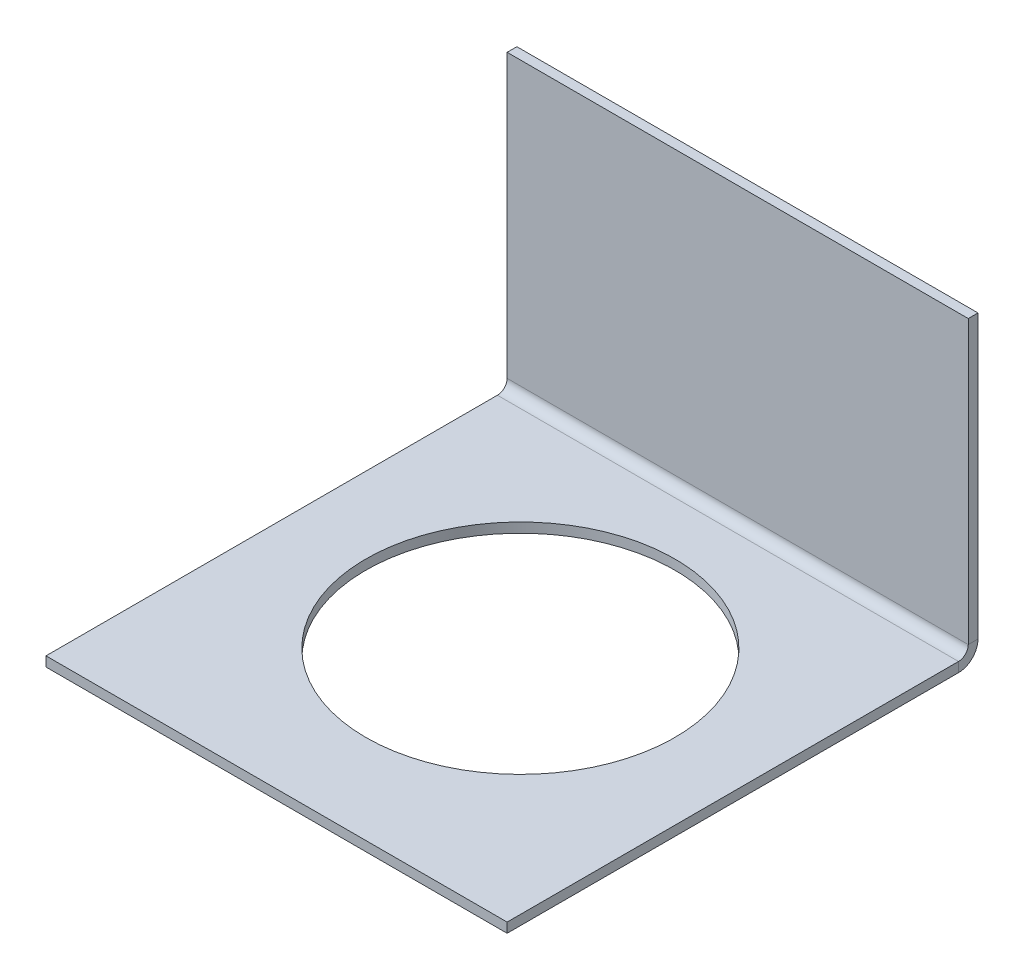
ISO-10303-21;
HEADER;
FILE_DESCRIPTION(('STEP AP214'),'2;1');
FILE_NAME('part.step','',(''),(''),'','','');
FILE_SCHEMA(('AUTOMOTIVE_DESIGN { 1 0 10303 214 1 1 1 1 }'));
ENDSEC;
DATA;
#1=APPLICATION_CONTEXT('core data for automotive mechanical design processes');
#2=APPLICATION_PROTOCOL_DEFINITION('international standard','automotive_design',2000,#1);
#3=PRODUCT_CONTEXT('',#1,'mechanical');
#4=PRODUCT('Part','Part','',(#3));
#5=PRODUCT_RELATED_PRODUCT_CATEGORY('part','',(#4));
#6=PRODUCT_DEFINITION_FORMATION('','',#4);
#7=PRODUCT_DEFINITION_CONTEXT('part definition',#1,'design');
#8=PRODUCT_DEFINITION('design','',#6,#7);
#9=PRODUCT_DEFINITION_SHAPE('','',#8);
#10=(LENGTH_UNIT() NAMED_UNIT(*) SI_UNIT(.MILLI.,.METRE.));
#11=(NAMED_UNIT(*) PLANE_ANGLE_UNIT() SI_UNIT($,.RADIAN.));
#12=(NAMED_UNIT(*) SI_UNIT($,.STERADIAN.) SOLID_ANGLE_UNIT());
#13=UNCERTAINTY_MEASURE_WITH_UNIT(LENGTH_MEASURE(1.E-05),#10,'distance_accuracy_value','');
#14=(GEOMETRIC_REPRESENTATION_CONTEXT(3) GLOBAL_UNCERTAINTY_ASSIGNED_CONTEXT((#13)) GLOBAL_UNIT_ASSIGNED_CONTEXT((#10,
#11,#12)) REPRESENTATION_CONTEXT('',''));
#15=CARTESIAN_POINT('',(0.,0.,0.));
#16=DIRECTION('',(0.,0.,1.));
#17=DIRECTION('',(1.,0.,0.));
#18=AXIS2_PLACEMENT_3D('',#15,#16,#17);
#19=CARTESIAN_POINT('',(0.,-1.,0.));
#20=DIRECTION('',(-1.,0.,0.));
#21=DIRECTION('',(0.,0.,1.));
#22=AXIS2_PLACEMENT_3D('',#19,#20,#21);
#23=PLANE('',#22);
#24=DIRECTION('',(0.,0.,1.));
#25=VECTOR('',#24,1.);
#26=CARTESIAN_POINT('',(0.,0.,0.));
#27=LINE('',#26,#25);
#28=CARTESIAN_POINT('',(0.,0.,0.999999999999997));
#29=VERTEX_POINT('',#28);
#30=CARTESIAN_POINT('',(0.,0.,47.36));
#31=VERTEX_POINT('',#30);
#32=EDGE_CURVE('E89',#29,#31,#27,.T.);
#33=ORIENTED_EDGE('',*,*,#32,.F.);
#34=DIRECTION('',(0.,-1.,0.));
#35=VECTOR('',#34,1.);
#36=CARTESIAN_POINT('',(0.,0.,0.999999999999997));
#37=LINE('',#36,#35);
#38=CARTESIAN_POINT('',(0.,-1.00000000000001,0.999999999999997));
#39=VERTEX_POINT('',#38);
#40=EDGE_CURVE('E98',#29,#39,#37,.T.);
#41=ORIENTED_EDGE('',*,*,#40,.T.);
#42=DIRECTION('',(0.,0.,1.));
#43=VECTOR('',#42,1.);
#44=CARTESIAN_POINT('',(0.,-1.,0.));
#45=LINE('',#44,#43);
#46=CARTESIAN_POINT('',(0.,-1.,47.36));
#47=VERTEX_POINT('',#46);
#48=EDGE_CURVE('E86',#39,#47,#45,.T.);
#49=ORIENTED_EDGE('',*,*,#48,.T.);
#50=DIRECTION('',(0.,1.,0.));
#51=VECTOR('',#50,1.);
#52=CARTESIAN_POINT('',(0.,-1.,47.36));
#53=LINE('',#52,#51);
#54=EDGE_CURVE('E44',#47,#31,#53,.T.);
#55=ORIENTED_EDGE('',*,*,#54,.T.);
#56=EDGE_LOOP('',(#33,#41,#49,#55));
#57=FACE_BOUND('',#56,.T.);
#58=ADVANCED_FACE('F41',(#57),#23,.T.);
#59=CARTESIAN_POINT('',(0.,-1.,0.));
#60=DIRECTION('',(0.,1.,0.));
#61=DIRECTION('',(0.,0.,1.));
#62=AXIS2_PLACEMENT_3D('',#59,#60,#61);
#63=PLANE('',#62);
#64=CARTESIAN_POINT('',(23.68,-1.00000000000001,22.32));
#65=DIRECTION('',(0.,1.,0.));
#66=DIRECTION('',(0.,0.,1.));
#67=AXIS2_PLACEMENT_3D('',#64,#65,#66);
#68=CIRCLE('',#67,15.875);
#69=CARTESIAN_POINT('',(23.68,-1.00000000000001,38.195));
#70=VERTEX_POINT('',#69);
#71=EDGE_CURVE('E150',#70,#70,#68,.T.);
#72=ORIENTED_EDGE('',*,*,#71,.T.);
#73=EDGE_LOOP('',(#72));
#74=FACE_BOUND('',#73,.T.);
#75=DIRECTION('',(-1.,0.,0.));
#76=VECTOR('',#75,1.);
#77=CARTESIAN_POINT('',(0.,-1.00000000000001,0.999999999999997));
#78=LINE('',#77,#76);
#79=CARTESIAN_POINT('',(47.36,-1.,0.999999999999997));
#80=VERTEX_POINT('',#79);
#81=EDGE_CURVE('E114',#39,#80,#78,.F.);
#82=ORIENTED_EDGE('',*,*,#81,.T.);
#83=DIRECTION('',(0.,0.,-1.));
#84=VECTOR('',#83,1.);
#85=CARTESIAN_POINT('',(47.36,-1.,0.));
#86=LINE('',#85,#84);
#87=CARTESIAN_POINT('',(47.36,-1.,47.36));
#88=VERTEX_POINT('',#87);
#89=EDGE_CURVE('E94',#88,#80,#86,.T.);
#90=ORIENTED_EDGE('',*,*,#89,.F.);
#91=DIRECTION('',(1.,0.,0.));
#92=VECTOR('',#91,1.);
#93=CARTESIAN_POINT('',(0.,-1.,47.36));
#94=LINE('',#93,#92);
#95=EDGE_CURVE('E79',#47,#88,#94,.T.);
#96=ORIENTED_EDGE('',*,*,#95,.F.);
#97=ORIENTED_EDGE('',*,*,#48,.F.);
#98=EDGE_LOOP('',(#82,#90,#96,#97));
#99=FACE_BOUND('',#98,.T.);
#100=ADVANCED_FACE('F161',(#74,#99),#63,.F.);
#101=CARTESIAN_POINT('',(0.,0.,0.));
#102=DIRECTION('',(0.,1.,0.));
#103=DIRECTION('',(0.,0.,1.));
#104=AXIS2_PLACEMENT_3D('',#101,#102,#103);
#105=PLANE('',#104);
#106=CARTESIAN_POINT('',(23.68,0.,22.32));
#107=DIRECTION('',(0.,1.,0.));
#108=DIRECTION('',(0.,0.,1.));
#109=AXIS2_PLACEMENT_3D('',#106,#107,#108);
#110=CIRCLE('',#109,15.875);
#111=CARTESIAN_POINT('',(23.68,0.,38.195));
#112=VERTEX_POINT('',#111);
#113=EDGE_CURVE('E155',#112,#112,#110,.T.);
#114=ORIENTED_EDGE('',*,*,#113,.F.);
#115=EDGE_LOOP('',(#114));
#116=FACE_BOUND('',#115,.T.);
#117=DIRECTION('',(0.,0.,-1.));
#118=VECTOR('',#117,1.);
#119=CARTESIAN_POINT('',(47.36,0.,0.));
#120=LINE('',#119,#118);
#121=CARTESIAN_POINT('',(47.36,0.,47.36));
#122=VERTEX_POINT('',#121);
#123=CARTESIAN_POINT('',(47.36,0.,0.999999999999997));
#124=VERTEX_POINT('',#123);
#125=EDGE_CURVE('E81',#122,#124,#120,.T.);
#126=ORIENTED_EDGE('',*,*,#125,.T.);
#127=DIRECTION('',(-1.,0.,0.));
#128=VECTOR('',#127,1.);
#129=CARTESIAN_POINT('',(0.,0.,0.999999999999997));
#130=LINE('',#129,#128);
#131=EDGE_CURVE('E55',#29,#124,#130,.F.);
#132=ORIENTED_EDGE('',*,*,#131,.F.);
#133=ORIENTED_EDGE('',*,*,#32,.T.);
#134=DIRECTION('',(1.,0.,0.));
#135=VECTOR('',#134,1.);
#136=CARTESIAN_POINT('',(0.,0.,47.36));
#137=LINE('',#136,#135);
#138=EDGE_CURVE('E77',#31,#122,#137,.T.);
#139=ORIENTED_EDGE('',*,*,#138,.T.);
#140=EDGE_LOOP('',(#126,#132,#133,#139));
#141=FACE_BOUND('',#140,.T.);
#142=ADVANCED_FACE('F88',(#116,#141),#105,.T.);
#143=CARTESIAN_POINT('',(47.36,-1.,0.));
#144=DIRECTION('',(1.,0.,0.));
#145=DIRECTION('',(0.,0.,-1.));
#146=AXIS2_PLACEMENT_3D('',#143,#144,#145);
#147=PLANE('',#146);
#148=DIRECTION('',(0.,-1.,0.));
#149=VECTOR('',#148,1.);
#150=CARTESIAN_POINT('',(47.36,0.,0.999999999999997));
#151=LINE('',#150,#149);
#152=EDGE_CURVE('E85',#124,#80,#151,.T.);
#153=ORIENTED_EDGE('',*,*,#152,.F.);
#154=ORIENTED_EDGE('',*,*,#125,.F.);
#155=DIRECTION('',(0.,1.,0.));
#156=VECTOR('',#155,1.);
#157=CARTESIAN_POINT('',(47.36,-1.,47.36));
#158=LINE('',#157,#156);
#159=EDGE_CURVE('E11',#88,#122,#158,.T.);
#160=ORIENTED_EDGE('',*,*,#159,.F.);
#161=ORIENTED_EDGE('',*,*,#89,.T.);
#162=EDGE_LOOP('',(#153,#154,#160,#161));
#163=FACE_BOUND('',#162,.T.);
#164=ADVANCED_FACE('F82',(#163),#147,.T.);
#165=CARTESIAN_POINT('',(0.,-1.,47.36));
#166=DIRECTION('',(0.,0.,1.));
#167=DIRECTION('',(1.,0.,0.));
#168=AXIS2_PLACEMENT_3D('',#165,#166,#167);
#169=PLANE('',#168);
#170=ORIENTED_EDGE('',*,*,#138,.F.);
#171=ORIENTED_EDGE('',*,*,#54,.F.);
#172=ORIENTED_EDGE('',*,*,#95,.T.);
#173=ORIENTED_EDGE('',*,*,#159,.T.);
#174=EDGE_LOOP('',(#170,#171,#172,#173));
#175=FACE_BOUND('',#174,.T.);
#176=ADVANCED_FACE('F74',(#175),#169,.T.);
#177=CARTESIAN_POINT('',(47.36,0.99999999999999,0.999999999999997));
#178=DIRECTION('',(1.,0.,0.));
#179=DIRECTION('',(0.,0.,-1.));
#180=AXIS2_PLACEMENT_3D('',#177,#178,#179);
#181=PLANE('',#180);
#182=DIRECTION('',(0.,0.,-1.));
#183=VECTOR('',#182,1.);
#184=CARTESIAN_POINT('',(47.36,0.999999999999997,0.));
#185=LINE('',#184,#183);
#186=CARTESIAN_POINT('',(47.36,0.999999999999986,0.));
#187=VERTEX_POINT('',#186);
#188=CARTESIAN_POINT('',(47.36,0.999999999999983,-1.));
#189=VERTEX_POINT('',#188);
#190=EDGE_CURVE('E146',#187,#189,#185,.T.);
#191=ORIENTED_EDGE('',*,*,#190,.F.);
#192=CARTESIAN_POINT('',(47.36,0.99999999999999,0.999999999999997));
#193=DIRECTION('',(-1.,0.,0.));
#194=DIRECTION('',(0.,0.,1.));
#195=AXIS2_PLACEMENT_3D('',#192,#193,#194);
#196=CIRCLE('',#195,1.);
#197=EDGE_CURVE('E108',#124,#187,#196,.F.);
#198=ORIENTED_EDGE('',*,*,#197,.F.);
#199=ORIENTED_EDGE('',*,*,#152,.T.);
#200=CARTESIAN_POINT('',(47.36,0.99999999999999,0.999999999999997));
#201=DIRECTION('',(-1.,0.,0.));
#202=DIRECTION('',(0.,0.,1.));
#203=AXIS2_PLACEMENT_3D('',#200,#201,#202);
#204=CIRCLE('',#203,2.);
#205=EDGE_CURVE('E101',#80,#189,#204,.F.);
#206=ORIENTED_EDGE('',*,*,#205,.T.);
#207=EDGE_LOOP('',(#191,#198,#199,#206));
#208=FACE_BOUND('',#207,.T.);
#209=ADVANCED_FACE('F230',(#208),#181,.T.);
#210=CARTESIAN_POINT('',(0.,0.99999999999999,0.999999999999997));
#211=DIRECTION('',(1.,0.,0.));
#212=DIRECTION('',(0.,0.,-1.));
#213=AXIS2_PLACEMENT_3D('',#210,#211,#212);
#214=PLANE('',#213);
#215=CARTESIAN_POINT('',(0.,0.99999999999999,0.999999999999997));
#216=DIRECTION('',(-1.,0.,0.));
#217=DIRECTION('',(0.,0.,1.));
#218=AXIS2_PLACEMENT_3D('',#215,#216,#217);
#219=CIRCLE('',#218,1.);
#220=CARTESIAN_POINT('',(0.,0.999999999999986,0.));
#221=VERTEX_POINT('',#220);
#222=EDGE_CURVE('E103',#221,#29,#219,.T.);
#223=ORIENTED_EDGE('',*,*,#222,.F.);
#224=DIRECTION('',(0.,0.,-1.));
#225=VECTOR('',#224,1.);
#226=CARTESIAN_POINT('',(0.,0.999999999999997,0.));
#227=LINE('',#226,#225);
#228=CARTESIAN_POINT('',(0.,1.,-1.));
#229=VERTEX_POINT('',#228);
#230=EDGE_CURVE('E145',#221,#229,#227,.T.);
#231=ORIENTED_EDGE('',*,*,#230,.T.);
#232=CARTESIAN_POINT('',(0.,0.99999999999999,0.999999999999997));
#233=DIRECTION('',(-1.,0.,0.));
#234=DIRECTION('',(0.,0.,1.));
#235=AXIS2_PLACEMENT_3D('',#232,#233,#234);
#236=CIRCLE('',#235,2.);
#237=EDGE_CURVE('E111',#229,#39,#236,.T.);
#238=ORIENTED_EDGE('',*,*,#237,.T.);
#239=ORIENTED_EDGE('',*,*,#40,.F.);
#240=EDGE_LOOP('',(#223,#231,#238,#239));
#241=FACE_BOUND('',#240,.T.);
#242=ADVANCED_FACE('F188',(#241),#214,.F.);
#243=CARTESIAN_POINT('',(0.,0.99999999999999,0.999999999999997));
#244=DIRECTION('',(-1.,0.,0.));
#245=DIRECTION('',(0.,0.,-1.));
#246=AXIS2_PLACEMENT_3D('',#243,#244,#245);
#247=CYLINDRICAL_SURFACE('',#246,2.);
#248=ORIENTED_EDGE('',*,*,#81,.F.);
#249=ORIENTED_EDGE('',*,*,#237,.F.);
#250=DIRECTION('',(1.,0.,0.));
#251=VECTOR('',#250,1.);
#252=CARTESIAN_POINT('',(0.,1.,-1.));
#253=LINE('',#252,#251);
#254=EDGE_CURVE('E135',#229,#189,#253,.T.);
#255=ORIENTED_EDGE('',*,*,#254,.T.);
#256=ORIENTED_EDGE('',*,*,#205,.F.);
#257=EDGE_LOOP('',(#248,#249,#255,#256));
#258=FACE_BOUND('',#257,.T.);
#259=ADVANCED_FACE('F231',(#258),#247,.T.);
#260=CARTESIAN_POINT('',(0.,0.99999999999999,0.999999999999997));
#261=DIRECTION('',(-1.,0.,0.));
#262=DIRECTION('',(0.,0.,-1.));
#263=AXIS2_PLACEMENT_3D('',#260,#261,#262);
#264=CYLINDRICAL_SURFACE('',#263,1.);
#265=ORIENTED_EDGE('',*,*,#131,.T.);
#266=ORIENTED_EDGE('',*,*,#197,.T.);
#267=DIRECTION('',(-1.,0.,0.));
#268=VECTOR('',#267,1.);
#269=CARTESIAN_POINT('',(47.36,0.999999999999997,0.));
#270=LINE('',#269,#268);
#271=EDGE_CURVE('E149',#187,#221,#270,.T.);
#272=ORIENTED_EDGE('',*,*,#271,.T.);
#273=ORIENTED_EDGE('',*,*,#222,.T.);
#274=EDGE_LOOP('',(#265,#266,#272,#273));
#275=FACE_BOUND('',#274,.T.);
#276=ADVANCED_FACE('F193',(#275),#264,.F.);
#277=CARTESIAN_POINT('',(0.,30.,-1.0000000000001));
#278=DIRECTION('',(1.,0.,0.));
#279=DIRECTION('',(0.,0.,-1.));
#280=AXIS2_PLACEMENT_3D('',#277,#278,#279);
#281=PLANE('',#280);
#282=ORIENTED_EDGE('',*,*,#230,.F.);
#283=DIRECTION('',(0.,1.,0.));
#284=VECTOR('',#283,1.);
#285=CARTESIAN_POINT('',(0.,30.,-1.04744440165294E-13));
#286=LINE('',#285,#284);
#287=CARTESIAN_POINT('',(0.,30.,-1.04744440165294E-13));
#288=VERTEX_POINT('',#287);
#289=EDGE_CURVE('E132',#221,#288,#286,.T.);
#290=ORIENTED_EDGE('',*,*,#289,.T.);
#291=DIRECTION('',(0.,0.,1.));
#292=VECTOR('',#291,1.);
#293=CARTESIAN_POINT('',(0.,30.,-1.0000000000001));
#294=LINE('',#293,#292);
#295=CARTESIAN_POINT('',(0.,30.,-1.0000000000001));
#296=VERTEX_POINT('',#295);
#297=EDGE_CURVE('E106',#296,#288,#294,.T.);
#298=ORIENTED_EDGE('',*,*,#297,.F.);
#299=DIRECTION('',(0.,1.,0.));
#300=VECTOR('',#299,1.);
#301=CARTESIAN_POINT('',(0.,30.,-1.0000000000001));
#302=LINE('',#301,#300);
#303=EDGE_CURVE('E128',#229,#296,#302,.T.);
#304=ORIENTED_EDGE('',*,*,#303,.F.);
#305=EDGE_LOOP('',(#282,#290,#298,#304));
#306=FACE_BOUND('',#305,.T.);
#307=ADVANCED_FACE('F237',(#306),#281,.F.);
#308=CARTESIAN_POINT('',(47.36,0.,-1.));
#309=DIRECTION('',(-1.,0.,0.));
#310=DIRECTION('',(0.,0.,1.));
#311=AXIS2_PLACEMENT_3D('',#308,#309,#310);
#312=PLANE('',#311);
#313=ORIENTED_EDGE('',*,*,#190,.T.);
#314=DIRECTION('',(0.,-1.,0.));
#315=VECTOR('',#314,1.);
#316=CARTESIAN_POINT('',(47.36,0.,-1.));
#317=LINE('',#316,#315);
#318=CARTESIAN_POINT('',(47.36,30.,-1.0000000000001));
#319=VERTEX_POINT('',#318);
#320=EDGE_CURVE('E124',#319,#189,#317,.T.);
#321=ORIENTED_EDGE('',*,*,#320,.F.);
#322=DIRECTION('',(0.,0.,1.));
#323=VECTOR('',#322,1.);
#324=CARTESIAN_POINT('',(47.36,30.,-1.0000000000001));
#325=LINE('',#324,#323);
#326=CARTESIAN_POINT('',(47.36,30.,-1.04744440165294E-13));
#327=VERTEX_POINT('',#326);
#328=EDGE_CURVE('E121',#319,#327,#325,.T.);
#329=ORIENTED_EDGE('',*,*,#328,.T.);
#330=DIRECTION('',(0.,-1.,0.));
#331=VECTOR('',#330,1.);
#332=CARTESIAN_POINT('',(47.36,0.,0.));
#333=LINE('',#332,#331);
#334=EDGE_CURVE('E125',#327,#187,#333,.T.);
#335=ORIENTED_EDGE('',*,*,#334,.T.);
#336=EDGE_LOOP('',(#313,#321,#329,#335));
#337=FACE_BOUND('',#336,.T.);
#338=ADVANCED_FACE('F209',(#337),#312,.F.);
#339=CARTESIAN_POINT('',(0.,0.,-1.));
#340=DIRECTION('',(0.,0.,1.));
#341=DIRECTION('',(0.,-1.,0.));
#342=AXIS2_PLACEMENT_3D('',#339,#340,#341);
#343=PLANE('',#342);
#344=ORIENTED_EDGE('',*,*,#254,.F.);
#345=ORIENTED_EDGE('',*,*,#303,.T.);
#346=DIRECTION('',(1.,0.,0.));
#347=VECTOR('',#346,1.);
#348=CARTESIAN_POINT('',(47.36,30.,-1.0000000000001));
#349=LINE('',#348,#347);
#350=EDGE_CURVE('E138',#296,#319,#349,.T.);
#351=ORIENTED_EDGE('',*,*,#350,.T.);
#352=ORIENTED_EDGE('',*,*,#320,.T.);
#353=EDGE_LOOP('',(#344,#345,#351,#352));
#354=FACE_BOUND('',#353,.T.);
#355=ADVANCED_FACE('F234',(#354),#343,.F.);
#356=CARTESIAN_POINT('',(0.,0.,0.));
#357=DIRECTION('',(0.,0.,1.));
#358=DIRECTION('',(0.,-1.,0.));
#359=AXIS2_PLACEMENT_3D('',#356,#357,#358);
#360=PLANE('',#359);
#361=ORIENTED_EDGE('',*,*,#289,.F.);
#362=ORIENTED_EDGE('',*,*,#271,.F.);
#363=ORIENTED_EDGE('',*,*,#334,.F.);
#364=DIRECTION('',(1.,0.,0.));
#365=VECTOR('',#364,1.);
#366=CARTESIAN_POINT('',(47.36,30.,-1.04744440165294E-13));
#367=LINE('',#366,#365);
#368=EDGE_CURVE('E129',#288,#327,#367,.T.);
#369=ORIENTED_EDGE('',*,*,#368,.F.);
#370=EDGE_LOOP('',(#361,#362,#363,#369));
#371=FACE_BOUND('',#370,.T.);
#372=ADVANCED_FACE('F202',(#371),#360,.T.);
#373=CARTESIAN_POINT('',(47.36,30.,-1.0000000000001));
#374=DIRECTION('',(0.,-1.,0.));
#375=DIRECTION('',(0.,0.,-1.));
#376=AXIS2_PLACEMENT_3D('',#373,#374,#375);
#377=PLANE('',#376);
#378=ORIENTED_EDGE('',*,*,#368,.T.);
#379=ORIENTED_EDGE('',*,*,#328,.F.);
#380=ORIENTED_EDGE('',*,*,#350,.F.);
#381=ORIENTED_EDGE('',*,*,#297,.T.);
#382=EDGE_LOOP('',(#378,#379,#380,#381));
#383=FACE_BOUND('',#382,.T.);
#384=ADVANCED_FACE('F167',(#383),#377,.F.);
#385=CARTESIAN_POINT('',(23.68,-1.00000000000001,22.32));
#386=DIRECTION('',(0.,1.,0.));
#387=DIRECTION('',(0.,0.,1.));
#388=AXIS2_PLACEMENT_3D('',#385,#386,#387);
#389=CYLINDRICAL_SURFACE('',#388,15.875);
#390=ORIENTED_EDGE('',*,*,#71,.F.);
#391=EDGE_LOOP('',(#390));
#392=FACE_BOUND('',#391,.T.);
#393=ORIENTED_EDGE('',*,*,#113,.T.);
#394=EDGE_LOOP('',(#393));
#395=FACE_BOUND('',#394,.T.);
#396=ADVANCED_FACE('F164',(#392,#395),#389,.F.);
#397=CLOSED_SHELL('',(#58,#100,#142,#164,#176,#209,#242,#259,#276,#307,#338,#355,#372,#384,#396));
#398=MANIFOLD_SOLID_BREP('B2',#397);
#399=ADVANCED_BREP_SHAPE_REPRESENTATION('',(#18,#398),#14);
#400=SHAPE_DEFINITION_REPRESENTATION(#9,#399);
ENDSEC;
END-ISO-10303-21;
